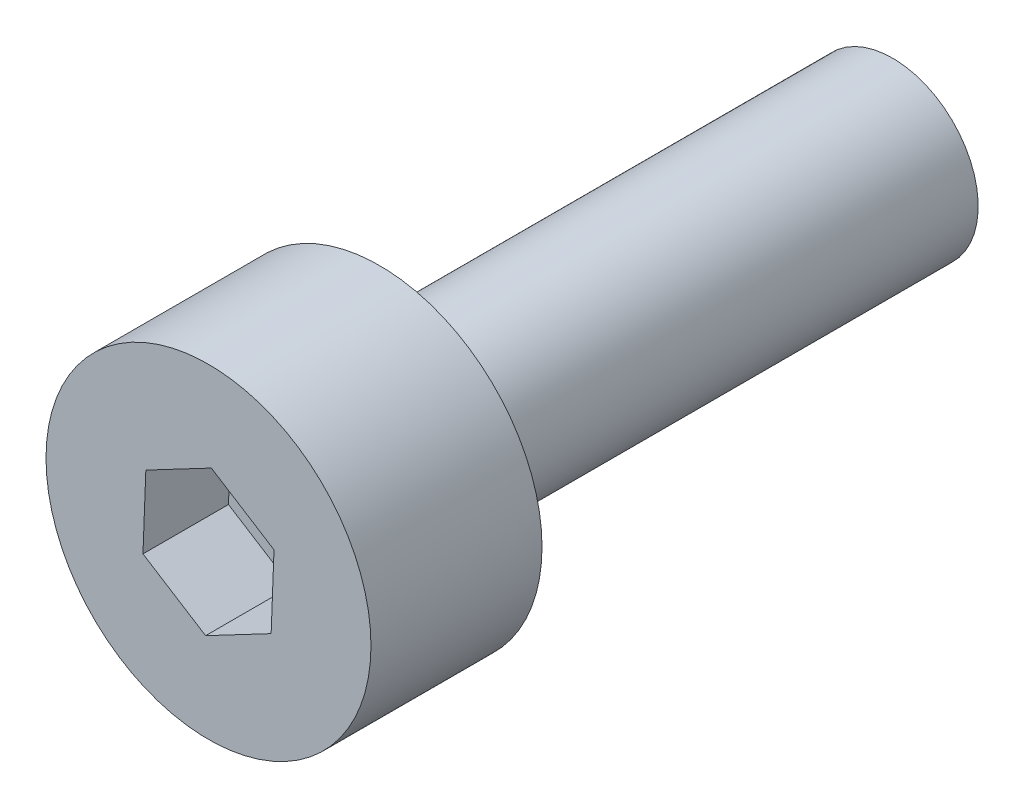
ISO-10303-21;
HEADER;
FILE_DESCRIPTION(('STEP AP214'),'2;1');
FILE_NAME('part.step','',(''),(''),'','','');
FILE_SCHEMA(('AUTOMOTIVE_DESIGN { 1 0 10303 214 1 1 1 1 }'));
ENDSEC;
DATA;
#1=APPLICATION_CONTEXT('core data for automotive mechanical design processes');
#2=APPLICATION_PROTOCOL_DEFINITION('international standard','automotive_design',2000,#1);
#3=PRODUCT_CONTEXT('',#1,'mechanical');
#4=PRODUCT('Part','Part','',(#3));
#5=PRODUCT_RELATED_PRODUCT_CATEGORY('part','',(#4));
#6=PRODUCT_DEFINITION_FORMATION('','',#4);
#7=PRODUCT_DEFINITION_CONTEXT('part definition',#1,'design');
#8=PRODUCT_DEFINITION('design','',#6,#7);
#9=PRODUCT_DEFINITION_SHAPE('','',#8);
#10=(LENGTH_UNIT() NAMED_UNIT(*) SI_UNIT(.MILLI.,.METRE.));
#11=(NAMED_UNIT(*) PLANE_ANGLE_UNIT() SI_UNIT($,.RADIAN.));
#12=(NAMED_UNIT(*) SI_UNIT($,.STERADIAN.) SOLID_ANGLE_UNIT());
#13=UNCERTAINTY_MEASURE_WITH_UNIT(LENGTH_MEASURE(1.E-05),#10,'distance_accuracy_value','');
#14=(GEOMETRIC_REPRESENTATION_CONTEXT(3) GLOBAL_UNCERTAINTY_ASSIGNED_CONTEXT((#13)) GLOBAL_UNIT_ASSIGNED_CONTEXT((#10,
#11,#12)) REPRESENTATION_CONTEXT('',''));
#15=CARTESIAN_POINT('',(0.,0.,0.));
#16=DIRECTION('',(0.,0.,1.));
#17=DIRECTION('',(1.,0.,0.));
#18=AXIS2_PLACEMENT_3D('',#15,#16,#17);
#19=CARTESIAN_POINT('',(0.,0.,2.));
#20=DIRECTION('',(0.,0.,-1.));
#21=DIRECTION('',(-1.,0.,0.));
#22=AXIS2_PLACEMENT_3D('',#19,#20,#21);
#23=CYLINDRICAL_SURFACE('',#22,1.9);
#24=CARTESIAN_POINT('',(0.,0.,2.));
#25=DIRECTION('',(0.,0.,1.));
#26=DIRECTION('',(1.,0.,0.));
#27=AXIS2_PLACEMENT_3D('',#24,#25,#26);
#28=CIRCLE('',#27,1.9);
#29=CARTESIAN_POINT('',(1.9,0.,2.));
#30=VERTEX_POINT('',#29);
#31=EDGE_CURVE('E50',#30,#30,#28,.T.);
#32=ORIENTED_EDGE('',*,*,#31,.F.);
#33=EDGE_LOOP('',(#32));
#34=FACE_BOUND('',#33,.T.);
#35=CARTESIAN_POINT('',(0.,0.,0.));
#36=DIRECTION('',(0.,0.,1.));
#37=DIRECTION('',(1.,0.,0.));
#38=AXIS2_PLACEMENT_3D('',#35,#36,#37);
#39=CIRCLE('',#38,1.9);
#40=CARTESIAN_POINT('',(1.9,0.,0.));
#41=VERTEX_POINT('',#40);
#42=EDGE_CURVE('E44',#41,#41,#39,.T.);
#43=ORIENTED_EDGE('',*,*,#42,.T.);
#44=EDGE_LOOP('',(#43));
#45=FACE_BOUND('',#44,.T.);
#46=ADVANCED_FACE('F41',(#34,#45),#23,.T.);
#47=CARTESIAN_POINT('',(0.,0.,2.));
#48=DIRECTION('',(0.,0.,1.));
#49=DIRECTION('',(1.,0.,0.));
#50=AXIS2_PLACEMENT_3D('',#47,#48,#49);
#51=PLANE('',#50);
#52=DIRECTION('',(0.845991028125538,-0.533197130835394,0.));
#53=VECTOR('',#52,1.);
#54=CARTESIAN_POINT('',(-0.399897848126545,-0.634493271094153,2.));
#55=LINE('',#54,#53);
#56=CARTESIAN_POINT('',(-0.76622270899176,-0.40361214082994,2.));
#57=VERTEX_POINT('',#56);
#58=CARTESIAN_POINT('',(-0.0335729872613293,-0.865374401358366,2.));
#59=VERTEX_POINT('',#58);
#60=EDGE_CURVE('E58',#57,#59,#55,.T.);
#61=ORIENTED_EDGE('',*,*,#60,.F.);
#62=DIRECTION('',(-0.0387667464656569,-0.999248287148128,0.));
#63=VECTOR('',#62,1.);
#64=CARTESIAN_POINT('',(-0.749436215361096,0.0290750598492427,2.));
#65=LINE('',#64,#63);
#66=CARTESIAN_POINT('',(-0.732649721730431,0.461762260528426,2.));
#67=VERTEX_POINT('',#66);
#68=EDGE_CURVE('E151',#67,#57,#65,.T.);
#69=ORIENTED_EDGE('',*,*,#68,.F.);
#70=DIRECTION('',(-0.884757774591195,-0.466051156312735,0.));
#71=VECTOR('',#70,1.);
#72=CARTESIAN_POINT('',(-0.349538367234551,0.663568330943396,2.));
#73=LINE('',#72,#71);
#74=CARTESIAN_POINT('',(0.0335729872613296,0.865374401358366,2.));
#75=VERTEX_POINT('',#74);
#76=EDGE_CURVE('E149',#75,#67,#73,.T.);
#77=ORIENTED_EDGE('',*,*,#76,.F.);
#78=DIRECTION('',(-0.845991028125538,0.533197130835393,0.));
#79=VECTOR('',#78,1.);
#80=CARTESIAN_POINT('',(0.399897848126545,0.634493271094153,2.));
#81=LINE('',#80,#79);
#82=CARTESIAN_POINT('',(0.766222708991761,0.40361214082994,2.));
#83=VERTEX_POINT('',#82);
#84=EDGE_CURVE('E106',#83,#75,#81,.T.);
#85=ORIENTED_EDGE('',*,*,#84,.F.);
#86=DIRECTION('',(0.0387667464656569,0.999248287148128,0.));
#87=VECTOR('',#86,1.);
#88=CARTESIAN_POINT('',(0.749436215361096,-0.0290750598492427,2.));
#89=LINE('',#88,#87);
#90=CARTESIAN_POINT('',(0.732649721730431,-0.461762260528426,2.));
#91=VERTEX_POINT('',#90);
#92=EDGE_CURVE('E143',#91,#83,#89,.T.);
#93=ORIENTED_EDGE('',*,*,#92,.F.);
#94=DIRECTION('',(0.884757774591195,0.466051156312735,0.));
#95=VECTOR('',#94,1.);
#96=CARTESIAN_POINT('',(0.349538367234551,-0.663568330943396,2.));
#97=LINE('',#96,#95);
#98=EDGE_CURVE('E139',#59,#91,#97,.T.);
#99=ORIENTED_EDGE('',*,*,#98,.F.);
#100=EDGE_LOOP('',(#61,#69,#77,#85,#93,#99));
#101=FACE_BOUND('',#100,.T.);
#102=ORIENTED_EDGE('',*,*,#31,.T.);
#103=EDGE_LOOP('',(#102));
#104=FACE_BOUND('',#103,.T.);
#105=ADVANCED_FACE('F182',(#101,#104),#51,.T.);
#106=CARTESIAN_POINT('',(0.,0.,0.));
#107=DIRECTION('',(0.,0.,1.));
#108=DIRECTION('',(1.,0.,0.));
#109=AXIS2_PLACEMENT_3D('',#106,#107,#108);
#110=PLANE('',#109);
#111=CARTESIAN_POINT('',(0.,0.,0.));
#112=DIRECTION('',(0.,0.,-1.));
#113=DIRECTION('',(-1.,0.,0.));
#114=AXIS2_PLACEMENT_3D('',#111,#112,#113);
#115=CIRCLE('',#114,1.);
#116=CARTESIAN_POINT('',(-1.,0.,0.));
#117=VERTEX_POINT('',#116);
#118=EDGE_CURVE('E11',#117,#117,#115,.T.);
#119=ORIENTED_EDGE('',*,*,#118,.F.);
#120=EDGE_LOOP('',(#119));
#121=FACE_BOUND('',#120,.T.);
#122=ORIENTED_EDGE('',*,*,#42,.F.);
#123=EDGE_LOOP('',(#122));
#124=FACE_BOUND('',#123,.T.);
#125=ADVANCED_FACE('F179',(#121,#124),#110,.F.);
#126=CARTESIAN_POINT('',(0.,0.,-6.));
#127=DIRECTION('',(0.,0.,1.));
#128=DIRECTION('',(1.,0.,0.));
#129=AXIS2_PLACEMENT_3D('',#126,#127,#128);
#130=CYLINDRICAL_SURFACE('',#129,1.);
#131=CARTESIAN_POINT('',(0.,0.,-6.));
#132=DIRECTION('',(0.,0.,-1.));
#133=DIRECTION('',(-1.,0.,0.));
#134=AXIS2_PLACEMENT_3D('',#131,#132,#133);
#135=CIRCLE('',#134,1.);
#136=CARTESIAN_POINT('',(-1.,0.,-6.));
#137=VERTEX_POINT('',#136);
#138=EDGE_CURVE('E157',#137,#137,#135,.T.);
#139=ORIENTED_EDGE('',*,*,#138,.F.);
#140=EDGE_LOOP('',(#139));
#141=FACE_BOUND('',#140,.T.);
#142=ORIENTED_EDGE('',*,*,#118,.T.);
#143=EDGE_LOOP('',(#142));
#144=FACE_BOUND('',#143,.T.);
#145=ADVANCED_FACE('F181',(#141,#144),#130,.T.);
#146=CARTESIAN_POINT('',(0.,0.,-6.));
#147=DIRECTION('',(0.,0.,-1.));
#148=DIRECTION('',(-1.,0.,0.));
#149=AXIS2_PLACEMENT_3D('',#146,#147,#148);
#150=PLANE('',#149);
#151=ORIENTED_EDGE('',*,*,#138,.T.);
#152=EDGE_LOOP('',(#151));
#153=FACE_BOUND('',#152,.T.);
#154=ADVANCED_FACE('F188',(#153),#150,.T.);
#155=CARTESIAN_POINT('',(-0.399897848126545,-0.634493271094153,1.));
#156=DIRECTION('',(-0.533197130835394,-0.845991028125538,0.));
#157=DIRECTION('',(0.845991028125538,-0.533197130835394,0.));
#158=AXIS2_PLACEMENT_3D('',#155,#156,#157);
#159=PLANE('',#158);
#160=ORIENTED_EDGE('',*,*,#60,.T.);
#161=DIRECTION('',(0.,0.,1.));
#162=VECTOR('',#161,1.);
#163=CARTESIAN_POINT('',(-0.0335729872613293,-0.865374401358366,1.));
#164=LINE('',#163,#162);
#165=CARTESIAN_POINT('',(-0.0335729872613293,-0.865374401358366,1.));
#166=VERTEX_POINT('',#165);
#167=EDGE_CURVE('E88',#166,#59,#164,.T.);
#168=ORIENTED_EDGE('',*,*,#167,.F.);
#169=DIRECTION('',(0.845991028125538,-0.533197130835394,0.));
#170=VECTOR('',#169,1.);
#171=CARTESIAN_POINT('',(-0.399897848126545,-0.634493271094153,1.));
#172=LINE('',#171,#170);
#173=CARTESIAN_POINT('',(-0.76622270899176,-0.40361214082994,1.));
#174=VERTEX_POINT('',#173);
#175=EDGE_CURVE('E154',#174,#166,#172,.T.);
#176=ORIENTED_EDGE('',*,*,#175,.F.);
#177=DIRECTION('',(0.,0.,1.));
#178=VECTOR('',#177,1.);
#179=CARTESIAN_POINT('',(-0.76622270899176,-0.40361214082994,1.));
#180=LINE('',#179,#178);
#181=EDGE_CURVE('E66',#174,#57,#180,.T.);
#182=ORIENTED_EDGE('',*,*,#181,.T.);
#183=EDGE_LOOP('',(#160,#168,#176,#182));
#184=FACE_BOUND('',#183,.T.);
#185=ADVANCED_FACE('F217',(#184),#159,.F.);
#186=CARTESIAN_POINT('',(-0.749436215361096,0.0290750598492427,1.));
#187=DIRECTION('',(-0.999248287148128,0.0387667464656569,0.));
#188=DIRECTION('',(-0.0387667464656569,-0.999248287148128,0.));
#189=AXIS2_PLACEMENT_3D('',#186,#187,#188);
#190=PLANE('',#189);
#191=ORIENTED_EDGE('',*,*,#68,.T.);
#192=ORIENTED_EDGE('',*,*,#181,.F.);
#193=DIRECTION('',(-0.0387667464656569,-0.999248287148128,0.));
#194=VECTOR('',#193,1.);
#195=CARTESIAN_POINT('',(-0.749436215361096,0.0290750598492427,1.));
#196=LINE('',#195,#194);
#197=CARTESIAN_POINT('',(-0.732649721730431,0.461762260528426,1.));
#198=VERTEX_POINT('',#197);
#199=EDGE_CURVE('E120',#198,#174,#196,.T.);
#200=ORIENTED_EDGE('',*,*,#199,.F.);
#201=DIRECTION('',(0.,0.,1.));
#202=VECTOR('',#201,1.);
#203=CARTESIAN_POINT('',(-0.732649721730431,0.461762260528426,1.));
#204=LINE('',#203,#202);
#205=EDGE_CURVE('E111',#198,#67,#204,.T.);
#206=ORIENTED_EDGE('',*,*,#205,.T.);
#207=EDGE_LOOP('',(#191,#192,#200,#206));
#208=FACE_BOUND('',#207,.T.);
#209=ADVANCED_FACE('F225',(#208),#190,.F.);
#210=CARTESIAN_POINT('',(-0.349538367234551,0.663568330943396,1.));
#211=DIRECTION('',(-0.466051156312734,0.884757774591195,0.));
#212=DIRECTION('',(-0.884757774591195,-0.466051156312734,0.));
#213=AXIS2_PLACEMENT_3D('',#210,#211,#212);
#214=PLANE('',#213);
#215=ORIENTED_EDGE('',*,*,#76,.T.);
#216=ORIENTED_EDGE('',*,*,#205,.F.);
#217=DIRECTION('',(-0.884757774591195,-0.466051156312735,0.));
#218=VECTOR('',#217,1.);
#219=CARTESIAN_POINT('',(-0.349538367234551,0.663568330943396,1.));
#220=LINE('',#219,#218);
#221=CARTESIAN_POINT('',(0.0335729872613296,0.865374401358366,1.));
#222=VERTEX_POINT('',#221);
#223=EDGE_CURVE('E115',#222,#198,#220,.T.);
#224=ORIENTED_EDGE('',*,*,#223,.F.);
#225=DIRECTION('',(0.,0.,1.));
#226=VECTOR('',#225,1.);
#227=CARTESIAN_POINT('',(0.0335729872613296,0.865374401358366,1.));
#228=LINE('',#227,#226);
#229=EDGE_CURVE('E99',#222,#75,#228,.T.);
#230=ORIENTED_EDGE('',*,*,#229,.T.);
#231=EDGE_LOOP('',(#215,#216,#224,#230));
#232=FACE_BOUND('',#231,.T.);
#233=ADVANCED_FACE('F116',(#232),#214,.F.);
#234=CARTESIAN_POINT('',(0.399897848126545,0.634493271094153,1.));
#235=DIRECTION('',(0.533197130835393,0.845991028125538,0.));
#236=DIRECTION('',(-0.845991028125538,0.533197130835393,0.));
#237=AXIS2_PLACEMENT_3D('',#234,#235,#236);
#238=PLANE('',#237);
#239=ORIENTED_EDGE('',*,*,#84,.T.);
#240=ORIENTED_EDGE('',*,*,#229,.F.);
#241=DIRECTION('',(-0.845991028125538,0.533197130835393,0.));
#242=VECTOR('',#241,1.);
#243=CARTESIAN_POINT('',(0.399897848126545,0.634493271094153,1.));
#244=LINE('',#243,#242);
#245=CARTESIAN_POINT('',(0.766222708991761,0.40361214082994,1.));
#246=VERTEX_POINT('',#245);
#247=EDGE_CURVE('E103',#246,#222,#244,.T.);
#248=ORIENTED_EDGE('',*,*,#247,.F.);
#249=DIRECTION('',(0.,0.,1.));
#250=VECTOR('',#249,1.);
#251=CARTESIAN_POINT('',(0.766222708991761,0.40361214082994,1.));
#252=LINE('',#251,#250);
#253=EDGE_CURVE('E112',#246,#83,#252,.T.);
#254=ORIENTED_EDGE('',*,*,#253,.T.);
#255=EDGE_LOOP('',(#239,#240,#248,#254));
#256=FACE_BOUND('',#255,.T.);
#257=ADVANCED_FACE('F101',(#256),#238,.F.);
#258=CARTESIAN_POINT('',(0.749436215361096,-0.0290750598492427,1.));
#259=DIRECTION('',(0.999248287148128,-0.0387667464656569,0.));
#260=DIRECTION('',(0.0387667464656569,0.999248287148128,0.));
#261=AXIS2_PLACEMENT_3D('',#258,#259,#260);
#262=PLANE('',#261);
#263=ORIENTED_EDGE('',*,*,#92,.T.);
#264=ORIENTED_EDGE('',*,*,#253,.F.);
#265=DIRECTION('',(0.0387667464656569,0.999248287148128,0.));
#266=VECTOR('',#265,1.);
#267=CARTESIAN_POINT('',(0.749436215361096,-0.0290750598492427,1.));
#268=LINE('',#267,#266);
#269=CARTESIAN_POINT('',(0.732649721730431,-0.461762260528426,1.));
#270=VERTEX_POINT('',#269);
#271=EDGE_CURVE('E126',#270,#246,#268,.T.);
#272=ORIENTED_EDGE('',*,*,#271,.F.);
#273=DIRECTION('',(0.,0.,1.));
#274=VECTOR('',#273,1.);
#275=CARTESIAN_POINT('',(0.732649721730431,-0.461762260528426,1.));
#276=LINE('',#275,#274);
#277=EDGE_CURVE('E162',#270,#91,#276,.T.);
#278=ORIENTED_EDGE('',*,*,#277,.T.);
#279=EDGE_LOOP('',(#263,#264,#272,#278));
#280=FACE_BOUND('',#279,.T.);
#281=ADVANCED_FACE('F247',(#280),#262,.F.);
#282=CARTESIAN_POINT('',(0.349538367234551,-0.663568330943396,1.));
#283=DIRECTION('',(0.466051156312735,-0.884757774591195,0.));
#284=DIRECTION('',(0.884757774591195,0.466051156312735,0.));
#285=AXIS2_PLACEMENT_3D('',#282,#283,#284);
#286=PLANE('',#285);
#287=ORIENTED_EDGE('',*,*,#98,.T.);
#288=ORIENTED_EDGE('',*,*,#277,.F.);
#289=DIRECTION('',(0.884757774591195,0.466051156312735,0.));
#290=VECTOR('',#289,1.);
#291=CARTESIAN_POINT('',(0.349538367234551,-0.663568330943396,1.));
#292=LINE('',#291,#290);
#293=EDGE_CURVE('E132',#166,#270,#292,.T.);
#294=ORIENTED_EDGE('',*,*,#293,.F.);
#295=ORIENTED_EDGE('',*,*,#167,.T.);
#296=EDGE_LOOP('',(#287,#288,#294,#295));
#297=FACE_BOUND('',#296,.T.);
#298=ADVANCED_FACE('F255',(#297),#286,.F.);
#299=CARTESIAN_POINT('',(0.,0.,1.));
#300=DIRECTION('',(0.,0.,1.));
#301=DIRECTION('',(1.,0.,0.));
#302=AXIS2_PLACEMENT_3D('',#299,#300,#301);
#303=PLANE('',#302);
#304=ORIENTED_EDGE('',*,*,#175,.T.);
#305=ORIENTED_EDGE('',*,*,#293,.T.);
#306=ORIENTED_EDGE('',*,*,#271,.T.);
#307=ORIENTED_EDGE('',*,*,#247,.T.);
#308=ORIENTED_EDGE('',*,*,#223,.T.);
#309=ORIENTED_EDGE('',*,*,#199,.T.);
#310=EDGE_LOOP('',(#304,#305,#306,#307,#308,#309));
#311=FACE_BOUND('',#310,.T.);
#312=ADVANCED_FACE('F123',(#311),#303,.T.);
#313=CLOSED_SHELL('',(#46,#105,#125,#145,#154,#185,#209,#233,#257,#281,#298,#312));
#314=MANIFOLD_SOLID_BREP('B2',#313);
#315=ADVANCED_BREP_SHAPE_REPRESENTATION('',(#18,#314),#14);
#316=SHAPE_DEFINITION_REPRESENTATION(#9,#315);
ENDSEC;
END-ISO-10303-21;
